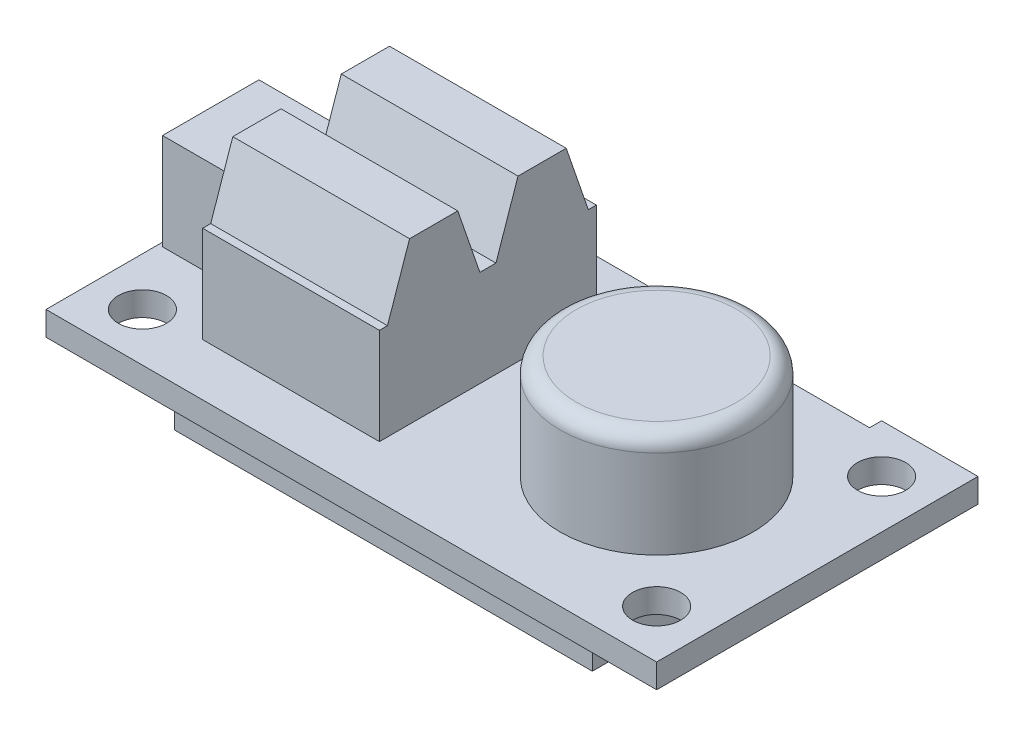
ISO-10303-21;
HEADER;
FILE_DESCRIPTION(('STEP AP214'),'2;1');
FILE_NAME('part.step','',(''),(''),'','','');
FILE_SCHEMA(('AUTOMOTIVE_DESIGN { 1 0 10303 214 1 1 1 1 }'));
ENDSEC;
DATA;
#1=APPLICATION_CONTEXT('core data for automotive mechanical design processes');
#2=APPLICATION_PROTOCOL_DEFINITION('international standard','automotive_design',2000,#1);
#3=PRODUCT_CONTEXT('',#1,'mechanical');
#4=PRODUCT('Part','Part','',(#3));
#5=PRODUCT_RELATED_PRODUCT_CATEGORY('part','',(#4));
#6=PRODUCT_DEFINITION_FORMATION('','',#4);
#7=PRODUCT_DEFINITION_CONTEXT('part definition',#1,'design');
#8=PRODUCT_DEFINITION('design','',#6,#7);
#9=PRODUCT_DEFINITION_SHAPE('','',#8);
#10=(LENGTH_UNIT() NAMED_UNIT(*) SI_UNIT(.MILLI.,.METRE.));
#11=(NAMED_UNIT(*) PLANE_ANGLE_UNIT() SI_UNIT($,.RADIAN.));
#12=(NAMED_UNIT(*) SI_UNIT($,.STERADIAN.) SOLID_ANGLE_UNIT());
#13=UNCERTAINTY_MEASURE_WITH_UNIT(LENGTH_MEASURE(1.E-05),#10,'distance_accuracy_value','');
#14=(GEOMETRIC_REPRESENTATION_CONTEXT(3) GLOBAL_UNCERTAINTY_ASSIGNED_CONTEXT((#13)) GLOBAL_UNIT_ASSIGNED_CONTEXT((#10,
#11,#12)) REPRESENTATION_CONTEXT('',''));
#15=CARTESIAN_POINT('',(0.,0.,0.));
#16=DIRECTION('',(0.,0.,1.));
#17=DIRECTION('',(1.,0.,0.));
#18=AXIS2_PLACEMENT_3D('',#15,#16,#17);
#19=CARTESIAN_POINT('',(0.,0.,0.));
#20=DIRECTION('',(0.,1.,0.));
#21=DIRECTION('',(0.,0.,1.));
#22=AXIS2_PLACEMENT_3D('',#19,#20,#21);
#23=PLANE('',#22);
#24=CARTESIAN_POINT('',(16.,0.,-7.00000000000001));
#25=DIRECTION('',(0.,1.,0.));
#26=DIRECTION('',(0.,0.,1.));
#27=AXIS2_PLACEMENT_3D('',#24,#25,#26);
#28=CIRCLE('',#27,1.5);
#29=CARTESIAN_POINT('',(16.,0.,-5.50000000000001));
#30=VERTEX_POINT('',#29);
#31=EDGE_CURVE('E361',#30,#30,#28,.T.);
#32=ORIENTED_EDGE('',*,*,#31,.T.);
#33=EDGE_LOOP('',(#32));
#34=FACE_BOUND('',#33,.T.);
#35=CARTESIAN_POINT('',(16.,0.,7.00000000000001));
#36=DIRECTION('',(0.,1.,0.));
#37=DIRECTION('',(0.,0.,1.));
#38=AXIS2_PLACEMENT_3D('',#35,#36,#37);
#39=CIRCLE('',#38,1.5);
#40=CARTESIAN_POINT('',(16.,0.,8.50000000000001));
#41=VERTEX_POINT('',#40);
#42=EDGE_CURVE('E369',#41,#41,#39,.T.);
#43=ORIENTED_EDGE('',*,*,#42,.T.);
#44=EDGE_LOOP('',(#43));
#45=FACE_BOUND('',#44,.T.);
#46=CARTESIAN_POINT('',(-16.,0.,7.00000000000001));
#47=DIRECTION('',(0.,1.,0.));
#48=DIRECTION('',(0.,0.,1.));
#49=AXIS2_PLACEMENT_3D('',#46,#47,#48);
#50=CIRCLE('',#49,1.5);
#51=CARTESIAN_POINT('',(-16.,0.,8.50000000000001));
#52=VERTEX_POINT('',#51);
#53=EDGE_CURVE('E375',#52,#52,#50,.T.);
#54=ORIENTED_EDGE('',*,*,#53,.T.);
#55=EDGE_LOOP('',(#54));
#56=FACE_BOUND('',#55,.T.);
#57=CARTESIAN_POINT('',(-16.,0.,-7.00000000000001));
#58=DIRECTION('',(0.,1.,0.));
#59=DIRECTION('',(0.,0.,1.));
#60=AXIS2_PLACEMENT_3D('',#57,#58,#59);
#61=CIRCLE('',#60,1.5);
#62=CARTESIAN_POINT('',(-16.,0.,-5.50000000000001));
#63=VERTEX_POINT('',#62);
#64=EDGE_CURVE('E381',#63,#63,#61,.T.);
#65=ORIENTED_EDGE('',*,*,#64,.T.);
#66=EDGE_LOOP('',(#65));
#67=FACE_BOUND('',#66,.T.);
#68=DIRECTION('',(-1.,0.,0.));
#69=VECTOR('',#68,1.);
#70=CARTESIAN_POINT('',(13.,0.,-10.));
#71=LINE('',#70,#69);
#72=CARTESIAN_POINT('',(19.,0.,-10.));
#73=VERTEX_POINT('',#72);
#74=CARTESIAN_POINT('',(13.,0.,-10.));
#75=VERTEX_POINT('',#74);
#76=EDGE_CURVE('E387',#73,#75,#71,.T.);
#77=ORIENTED_EDGE('',*,*,#76,.F.);
#78=DIRECTION('',(0.,0.,-1.));
#79=VECTOR('',#78,1.);
#80=CARTESIAN_POINT('',(19.,0.,10.));
#81=LINE('',#80,#79);
#82=CARTESIAN_POINT('',(19.,0.,10.));
#83=VERTEX_POINT('',#82);
#84=EDGE_CURVE('E394',#83,#73,#81,.T.);
#85=ORIENTED_EDGE('',*,*,#84,.F.);
#86=DIRECTION('',(1.,0.,0.));
#87=VECTOR('',#86,1.);
#88=CARTESIAN_POINT('',(-19.,0.,10.));
#89=LINE('',#88,#87);
#90=CARTESIAN_POINT('',(-19.,0.,10.));
#91=VERTEX_POINT('',#90);
#92=EDGE_CURVE('E421',#91,#83,#89,.T.);
#93=ORIENTED_EDGE('',*,*,#92,.F.);
#94=DIRECTION('',(0.,0.,1.));
#95=VECTOR('',#94,1.);
#96=CARTESIAN_POINT('',(-19.,0.,10.));
#97=LINE('',#96,#95);
#98=CARTESIAN_POINT('',(-19.,0.,-10.));
#99=VERTEX_POINT('',#98);
#100=EDGE_CURVE('E419',#99,#91,#97,.T.);
#101=ORIENTED_EDGE('',*,*,#100,.F.);
#102=DIRECTION('',(-1.,0.,0.));
#103=VECTOR('',#102,1.);
#104=CARTESIAN_POINT('',(-19.,0.,-10.));
#105=LINE('',#104,#103);
#106=CARTESIAN_POINT('',(0.999999999999999,0.,-10.));
#107=VERTEX_POINT('',#106);
#108=EDGE_CURVE('E417',#107,#99,#105,.T.);
#109=ORIENTED_EDGE('',*,*,#108,.F.);
#110=DIRECTION('',(0.,0.,-1.));
#111=VECTOR('',#110,1.);
#112=CARTESIAN_POINT('',(0.999999999999999,0.,-9.25));
#113=LINE('',#112,#111);
#114=CARTESIAN_POINT('',(0.999999999999999,0.,-9.25));
#115=VERTEX_POINT('',#114);
#116=EDGE_CURVE('E415',#115,#107,#113,.T.);
#117=ORIENTED_EDGE('',*,*,#116,.F.);
#118=DIRECTION('',(-1.,0.,0.));
#119=VECTOR('',#118,1.);
#120=CARTESIAN_POINT('',(13.,0.,-9.25));
#121=LINE('',#120,#119);
#122=CARTESIAN_POINT('',(13.,0.,-9.25));
#123=VERTEX_POINT('',#122);
#124=EDGE_CURVE('E413',#123,#115,#121,.T.);
#125=ORIENTED_EDGE('',*,*,#124,.F.);
#126=DIRECTION('',(0.,0.,1.));
#127=VECTOR('',#126,1.);
#128=CARTESIAN_POINT('',(13.,0.,-10.));
#129=LINE('',#128,#127);
#130=EDGE_CURVE('E411',#75,#123,#129,.T.);
#131=ORIENTED_EDGE('',*,*,#130,.F.);
#132=EDGE_LOOP('',(#77,#85,#93,#101,#109,#117,#125,#131));
#133=FACE_BOUND('',#132,.T.);
#134=DIRECTION('',(0.,0.,1.));
#135=VECTOR('',#134,1.);
#136=CARTESIAN_POINT('',(13.,0.,-8.));
#137=LINE('',#136,#135);
#138=CARTESIAN_POINT('',(13.,0.,-8.));
#139=VERTEX_POINT('',#138);
#140=CARTESIAN_POINT('',(13.,0.,8.));
#141=VERTEX_POINT('',#140);
#142=EDGE_CURVE('E241',#139,#141,#137,.T.);
#143=ORIENTED_EDGE('',*,*,#142,.F.);
#144=DIRECTION('',(1.,0.,0.));
#145=VECTOR('',#144,1.);
#146=CARTESIAN_POINT('',(-13.,0.,-8.));
#147=LINE('',#146,#145);
#148=CARTESIAN_POINT('',(-13.,0.,-8.));
#149=VERTEX_POINT('',#148);
#150=EDGE_CURVE('E238',#149,#139,#147,.T.);
#151=ORIENTED_EDGE('',*,*,#150,.F.);
#152=DIRECTION('',(0.,0.,-1.));
#153=VECTOR('',#152,1.);
#154=CARTESIAN_POINT('',(-13.,0.,-8.));
#155=LINE('',#154,#153);
#156=CARTESIAN_POINT('',(-13.,0.,8.));
#157=VERTEX_POINT('',#156);
#158=EDGE_CURVE('E56',#157,#149,#155,.T.);
#159=ORIENTED_EDGE('',*,*,#158,.F.);
#160=DIRECTION('',(-1.,0.,0.));
#161=VECTOR('',#160,1.);
#162=CARTESIAN_POINT('',(-13.,0.,8.));
#163=LINE('',#162,#161);
#164=EDGE_CURVE('E51',#141,#157,#163,.T.);
#165=ORIENTED_EDGE('',*,*,#164,.F.);
#166=EDGE_LOOP('',(#143,#151,#159,#165));
#167=FACE_BOUND('',#166,.T.);
#168=ADVANCED_FACE('F36',(#34,#45,#56,#67,#133,#167),#23,.F.);
#169=CARTESIAN_POINT('',(0.,1.5,0.));
#170=DIRECTION('',(0.,1.,0.));
#171=DIRECTION('',(0.,0.,1.));
#172=AXIS2_PLACEMENT_3D('',#169,#170,#171);
#173=PLANE('',#172);
#174=DIRECTION('',(0.,0.,-1.));
#175=VECTOR('',#174,1.);
#176=CARTESIAN_POINT('',(-1.5,1.5,6.75));
#177=LINE('',#176,#175);
#178=CARTESIAN_POINT('',(-1.5,1.5,6.75));
#179=VERTEX_POINT('',#178);
#180=CARTESIAN_POINT('',(-1.5,1.5,-6.75));
#181=VERTEX_POINT('',#180);
#182=EDGE_CURVE('E251',#179,#181,#177,.T.);
#183=ORIENTED_EDGE('',*,*,#182,.F.);
#184=DIRECTION('',(-1.,0.,0.));
#185=VECTOR('',#184,1.);
#186=CARTESIAN_POINT('',(-1.5,1.5,6.75));
#187=LINE('',#186,#185);
#188=CARTESIAN_POINT('',(-12.5,1.5,6.75));
#189=VERTEX_POINT('',#188);
#190=EDGE_CURVE('E276',#179,#189,#187,.T.);
#191=ORIENTED_EDGE('',*,*,#190,.T.);
#192=DIRECTION('',(0.,0.,-1.));
#193=VECTOR('',#192,1.);
#194=CARTESIAN_POINT('',(-12.5,1.5,6.75));
#195=LINE('',#194,#193);
#196=CARTESIAN_POINT('',(-12.5,1.5,-6.75));
#197=VERTEX_POINT('',#196);
#198=EDGE_CURVE('E242',#189,#197,#195,.T.);
#199=ORIENTED_EDGE('',*,*,#198,.T.);
#200=DIRECTION('',(-1.,0.,0.));
#201=VECTOR('',#200,1.);
#202=CARTESIAN_POINT('',(-1.5,1.5,-6.75));
#203=LINE('',#202,#201);
#204=EDGE_CURVE('E330',#181,#197,#203,.T.);
#205=ORIENTED_EDGE('',*,*,#204,.F.);
#206=EDGE_LOOP('',(#183,#191,#199,#205));
#207=FACE_BOUND('',#206,.T.);
#208=CARTESIAN_POINT('',(9.,1.5,0.));
#209=DIRECTION('',(0.,1.,0.));
#210=DIRECTION('',(0.,0.,1.));
#211=AXIS2_PLACEMENT_3D('',#208,#209,#210);
#212=CIRCLE('',#211,6.);
#213=CARTESIAN_POINT('',(9.,1.5,6.));
#214=VERTEX_POINT('',#213);
#215=EDGE_CURVE('E362',#214,#214,#212,.T.);
#216=ORIENTED_EDGE('',*,*,#215,.F.);
#217=EDGE_LOOP('',(#216));
#218=FACE_BOUND('',#217,.T.);
#219=CARTESIAN_POINT('',(16.,1.5,7.00000000000001));
#220=DIRECTION('',(0.,1.,0.));
#221=DIRECTION('',(0.,0.,1.));
#222=AXIS2_PLACEMENT_3D('',#219,#220,#221);
#223=CIRCLE('',#222,1.5);
#224=CARTESIAN_POINT('',(16.,1.5,8.50000000000001));
#225=VERTEX_POINT('',#224);
#226=EDGE_CURVE('E372',#225,#225,#223,.T.);
#227=ORIENTED_EDGE('',*,*,#226,.F.);
#228=EDGE_LOOP('',(#227));
#229=FACE_BOUND('',#228,.T.);
#230=CARTESIAN_POINT('',(-16.,1.5,-7.00000000000001));
#231=DIRECTION('',(0.,1.,0.));
#232=DIRECTION('',(0.,0.,1.));
#233=AXIS2_PLACEMENT_3D('',#230,#231,#232);
#234=CIRCLE('',#233,1.5);
#235=CARTESIAN_POINT('',(-16.,1.5,-5.50000000000001));
#236=VERTEX_POINT('',#235);
#237=EDGE_CURVE('E384',#236,#236,#234,.T.);
#238=ORIENTED_EDGE('',*,*,#237,.F.);
#239=EDGE_LOOP('',(#238));
#240=FACE_BOUND('',#239,.T.);
#241=DIRECTION('',(-1.,0.,0.));
#242=VECTOR('',#241,1.);
#243=CARTESIAN_POINT('',(13.,1.5,-10.));
#244=LINE('',#243,#242);
#245=CARTESIAN_POINT('',(19.,1.5,-10.));
#246=VERTEX_POINT('',#245);
#247=CARTESIAN_POINT('',(13.,1.5,-10.));
#248=VERTEX_POINT('',#247);
#249=EDGE_CURVE('E390',#246,#248,#244,.T.);
#250=ORIENTED_EDGE('',*,*,#249,.T.);
#251=DIRECTION('',(0.,0.,1.));
#252=VECTOR('',#251,1.);
#253=CARTESIAN_POINT('',(13.,1.5,-10.));
#254=LINE('',#253,#252);
#255=CARTESIAN_POINT('',(13.,1.5,-9.25));
#256=VERTEX_POINT('',#255);
#257=EDGE_CURVE('E393',#248,#256,#254,.T.);
#258=ORIENTED_EDGE('',*,*,#257,.T.);
#259=DIRECTION('',(-1.,0.,0.));
#260=VECTOR('',#259,1.);
#261=CARTESIAN_POINT('',(13.,1.5,-9.25));
#262=LINE('',#261,#260);
#263=CARTESIAN_POINT('',(0.999999999999999,1.5,-9.25));
#264=VERTEX_POINT('',#263);
#265=EDGE_CURVE('E396',#256,#264,#262,.T.);
#266=ORIENTED_EDGE('',*,*,#265,.T.);
#267=DIRECTION('',(0.,0.,-1.));
#268=VECTOR('',#267,1.);
#269=CARTESIAN_POINT('',(0.999999999999999,1.5,-9.25));
#270=LINE('',#269,#268);
#271=CARTESIAN_POINT('',(0.999999999999999,1.5,-10.));
#272=VERTEX_POINT('',#271);
#273=EDGE_CURVE('E398',#264,#272,#270,.T.);
#274=ORIENTED_EDGE('',*,*,#273,.T.);
#275=DIRECTION('',(-1.,0.,0.));
#276=VECTOR('',#275,1.);
#277=CARTESIAN_POINT('',(-19.,1.5,-10.));
#278=LINE('',#277,#276);
#279=CARTESIAN_POINT('',(-19.,1.5,-10.));
#280=VERTEX_POINT('',#279);
#281=EDGE_CURVE('E400',#272,#280,#278,.T.);
#282=ORIENTED_EDGE('',*,*,#281,.T.);
#283=DIRECTION('',(0.,0.,1.));
#284=VECTOR('',#283,1.);
#285=CARTESIAN_POINT('',(-19.,1.5,10.));
#286=LINE('',#285,#284);
#287=CARTESIAN_POINT('',(-19.,1.5,10.));
#288=VERTEX_POINT('',#287);
#289=EDGE_CURVE('E402',#280,#288,#286,.T.);
#290=ORIENTED_EDGE('',*,*,#289,.T.);
#291=DIRECTION('',(1.,0.,0.));
#292=VECTOR('',#291,1.);
#293=CARTESIAN_POINT('',(-19.,1.5,10.));
#294=LINE('',#293,#292);
#295=CARTESIAN_POINT('',(19.,1.5,10.));
#296=VERTEX_POINT('',#295);
#297=EDGE_CURVE('E404',#288,#296,#294,.T.);
#298=ORIENTED_EDGE('',*,*,#297,.T.);
#299=DIRECTION('',(0.,0.,-1.));
#300=VECTOR('',#299,1.);
#301=CARTESIAN_POINT('',(19.,1.5,10.));
#302=LINE('',#301,#300);
#303=EDGE_CURVE('E406',#296,#246,#302,.T.);
#304=ORIENTED_EDGE('',*,*,#303,.T.);
#305=EDGE_LOOP('',(#250,#258,#266,#274,#282,#290,#298,#304));
#306=FACE_BOUND('',#305,.T.);
#307=CARTESIAN_POINT('',(-16.,1.5,7.00000000000001));
#308=DIRECTION('',(0.,1.,0.));
#309=DIRECTION('',(0.,0.,1.));
#310=AXIS2_PLACEMENT_3D('',#307,#308,#309);
#311=CIRCLE('',#310,1.5);
#312=CARTESIAN_POINT('',(-16.,1.5,8.50000000000001));
#313=VERTEX_POINT('',#312);
#314=EDGE_CURVE('E378',#313,#313,#311,.T.);
#315=ORIENTED_EDGE('',*,*,#314,.F.);
#316=EDGE_LOOP('',(#315));
#317=FACE_BOUND('',#316,.T.);
#318=CARTESIAN_POINT('',(16.,1.5,-7.00000000000001));
#319=DIRECTION('',(0.,1.,0.));
#320=DIRECTION('',(0.,0.,1.));
#321=AXIS2_PLACEMENT_3D('',#318,#319,#320);
#322=CIRCLE('',#321,1.5);
#323=CARTESIAN_POINT('',(16.,1.5,-5.50000000000001));
#324=VERTEX_POINT('',#323);
#325=EDGE_CURVE('E366',#324,#324,#322,.T.);
#326=ORIENTED_EDGE('',*,*,#325,.F.);
#327=EDGE_LOOP('',(#326));
#328=FACE_BOUND('',#327,.T.);
#329=DIRECTION('',(-1.,0.,0.));
#330=VECTOR('',#329,1.);
#331=CARTESIAN_POINT('',(-18.75,1.5,-3.));
#332=LINE('',#331,#330);
#333=CARTESIAN_POINT('',(-13.75,1.5,-3.));
#334=VERTEX_POINT('',#333);
#335=CARTESIAN_POINT('',(-18.75,1.5,-3.));
#336=VERTEX_POINT('',#335);
#337=EDGE_CURVE('E346',#334,#336,#332,.T.);
#338=ORIENTED_EDGE('',*,*,#337,.F.);
#339=DIRECTION('',(0.,0.,-1.));
#340=VECTOR('',#339,1.);
#341=CARTESIAN_POINT('',(-13.75,1.5,-3.));
#342=LINE('',#341,#340);
#343=CARTESIAN_POINT('',(-13.75,1.5,3.));
#344=VERTEX_POINT('',#343);
#345=EDGE_CURVE('E332',#344,#334,#342,.T.);
#346=ORIENTED_EDGE('',*,*,#345,.F.);
#347=DIRECTION('',(1.,0.,0.));
#348=VECTOR('',#347,1.);
#349=CARTESIAN_POINT('',(-18.75,1.5,3.));
#350=LINE('',#349,#348);
#351=CARTESIAN_POINT('',(-18.75,1.5,3.));
#352=VERTEX_POINT('',#351);
#353=EDGE_CURVE('E337',#352,#344,#350,.T.);
#354=ORIENTED_EDGE('',*,*,#353,.F.);
#355=DIRECTION('',(0.,0.,1.));
#356=VECTOR('',#355,1.);
#357=CARTESIAN_POINT('',(-18.75,1.5,-3.));
#358=LINE('',#357,#356);
#359=EDGE_CURVE('E348',#336,#352,#358,.T.);
#360=ORIENTED_EDGE('',*,*,#359,.F.);
#361=EDGE_LOOP('',(#338,#346,#354,#360));
#362=FACE_BOUND('',#361,.T.);
#363=ADVANCED_FACE('F464',(#207,#218,#229,#240,#306,#317,#328,#362),#173,.T.);
#364=CARTESIAN_POINT('',(13.,1.5,-10.));
#365=DIRECTION('',(0.,0.,1.));
#366=DIRECTION('',(1.,0.,0.));
#367=AXIS2_PLACEMENT_3D('',#364,#365,#366);
#368=PLANE('',#367);
#369=ORIENTED_EDGE('',*,*,#76,.T.);
#370=DIRECTION('',(0.,-1.,0.));
#371=VECTOR('',#370,1.);
#372=CARTESIAN_POINT('',(13.,1.5,-10.));
#373=LINE('',#372,#371);
#374=EDGE_CURVE('E365',#248,#75,#373,.T.);
#375=ORIENTED_EDGE('',*,*,#374,.F.);
#376=ORIENTED_EDGE('',*,*,#249,.F.);
#377=DIRECTION('',(0.,-1.,0.));
#378=VECTOR('',#377,1.);
#379=CARTESIAN_POINT('',(19.,1.5,-10.));
#380=LINE('',#379,#378);
#381=EDGE_CURVE('E408',#246,#73,#380,.T.);
#382=ORIENTED_EDGE('',*,*,#381,.T.);
#383=EDGE_LOOP('',(#369,#375,#376,#382));
#384=FACE_BOUND('',#383,.T.);
#385=ADVANCED_FACE('F470',(#384),#368,.F.);
#386=CARTESIAN_POINT('',(13.,1.5,-10.));
#387=DIRECTION('',(1.,0.,0.));
#388=DIRECTION('',(0.,0.,-1.));
#389=AXIS2_PLACEMENT_3D('',#386,#387,#388);
#390=PLANE('',#389);
#391=ORIENTED_EDGE('',*,*,#130,.T.);
#392=DIRECTION('',(0.,-1.,0.));
#393=VECTOR('',#392,1.);
#394=CARTESIAN_POINT('',(13.,1.5,-9.25));
#395=LINE('',#394,#393);
#396=EDGE_CURVE('E441',#256,#123,#395,.T.);
#397=ORIENTED_EDGE('',*,*,#396,.F.);
#398=ORIENTED_EDGE('',*,*,#257,.F.);
#399=ORIENTED_EDGE('',*,*,#374,.T.);
#400=EDGE_LOOP('',(#391,#397,#398,#399));
#401=FACE_BOUND('',#400,.T.);
#402=ADVANCED_FACE('F500',(#401),#390,.F.);
#403=CARTESIAN_POINT('',(13.,1.5,-9.25));
#404=DIRECTION('',(0.,0.,1.));
#405=DIRECTION('',(1.,0.,0.));
#406=AXIS2_PLACEMENT_3D('',#403,#404,#405);
#407=PLANE('',#406);
#408=ORIENTED_EDGE('',*,*,#124,.T.);
#409=DIRECTION('',(0.,-1.,0.));
#410=VECTOR('',#409,1.);
#411=CARTESIAN_POINT('',(0.999999999999999,1.5,-9.25));
#412=LINE('',#411,#410);
#413=EDGE_CURVE('E438',#264,#115,#412,.T.);
#414=ORIENTED_EDGE('',*,*,#413,.F.);
#415=ORIENTED_EDGE('',*,*,#265,.F.);
#416=ORIENTED_EDGE('',*,*,#396,.T.);
#417=EDGE_LOOP('',(#408,#414,#415,#416));
#418=FACE_BOUND('',#417,.T.);
#419=ADVANCED_FACE('F496',(#418),#407,.F.);
#420=CARTESIAN_POINT('',(0.999999999999999,1.5,-9.25));
#421=DIRECTION('',(-1.,0.,0.));
#422=DIRECTION('',(0.,0.,1.));
#423=AXIS2_PLACEMENT_3D('',#420,#421,#422);
#424=PLANE('',#423);
#425=ORIENTED_EDGE('',*,*,#116,.T.);
#426=DIRECTION('',(0.,-1.,0.));
#427=VECTOR('',#426,1.);
#428=CARTESIAN_POINT('',(0.999999999999999,1.5,-10.));
#429=LINE('',#428,#427);
#430=EDGE_CURVE('E435',#272,#107,#429,.T.);
#431=ORIENTED_EDGE('',*,*,#430,.F.);
#432=ORIENTED_EDGE('',*,*,#273,.F.);
#433=ORIENTED_EDGE('',*,*,#413,.T.);
#434=EDGE_LOOP('',(#425,#431,#432,#433));
#435=FACE_BOUND('',#434,.T.);
#436=ADVANCED_FACE('F492',(#435),#424,.F.);
#437=CARTESIAN_POINT('',(-19.,1.5,-10.));
#438=DIRECTION('',(0.,0.,1.));
#439=DIRECTION('',(1.,0.,0.));
#440=AXIS2_PLACEMENT_3D('',#437,#438,#439);
#441=PLANE('',#440);
#442=ORIENTED_EDGE('',*,*,#108,.T.);
#443=DIRECTION('',(0.,-1.,0.));
#444=VECTOR('',#443,1.);
#445=CARTESIAN_POINT('',(-19.,1.5,-10.));
#446=LINE('',#445,#444);
#447=EDGE_CURVE('E432',#280,#99,#446,.T.);
#448=ORIENTED_EDGE('',*,*,#447,.F.);
#449=ORIENTED_EDGE('',*,*,#281,.F.);
#450=ORIENTED_EDGE('',*,*,#430,.T.);
#451=EDGE_LOOP('',(#442,#448,#449,#450));
#452=FACE_BOUND('',#451,.T.);
#453=ADVANCED_FACE('F488',(#452),#441,.F.);
#454=CARTESIAN_POINT('',(-19.,1.5,10.));
#455=DIRECTION('',(1.,0.,0.));
#456=DIRECTION('',(0.,0.,-1.));
#457=AXIS2_PLACEMENT_3D('',#454,#455,#456);
#458=PLANE('',#457);
#459=ORIENTED_EDGE('',*,*,#100,.T.);
#460=DIRECTION('',(0.,-1.,0.));
#461=VECTOR('',#460,1.);
#462=CARTESIAN_POINT('',(-19.,1.5,10.));
#463=LINE('',#462,#461);
#464=EDGE_CURVE('E429',#288,#91,#463,.T.);
#465=ORIENTED_EDGE('',*,*,#464,.F.);
#466=ORIENTED_EDGE('',*,*,#289,.F.);
#467=ORIENTED_EDGE('',*,*,#447,.T.);
#468=EDGE_LOOP('',(#459,#465,#466,#467));
#469=FACE_BOUND('',#468,.T.);
#470=ADVANCED_FACE('F484',(#469),#458,.F.);
#471=CARTESIAN_POINT('',(-19.,1.5,10.));
#472=DIRECTION('',(0.,0.,-1.));
#473=DIRECTION('',(-1.,0.,0.));
#474=AXIS2_PLACEMENT_3D('',#471,#472,#473);
#475=PLANE('',#474);
#476=ORIENTED_EDGE('',*,*,#92,.T.);
#477=DIRECTION('',(0.,-1.,0.));
#478=VECTOR('',#477,1.);
#479=CARTESIAN_POINT('',(19.,1.5,10.));
#480=LINE('',#479,#478);
#481=EDGE_CURVE('E426',#296,#83,#480,.T.);
#482=ORIENTED_EDGE('',*,*,#481,.F.);
#483=ORIENTED_EDGE('',*,*,#297,.F.);
#484=ORIENTED_EDGE('',*,*,#464,.T.);
#485=EDGE_LOOP('',(#476,#482,#483,#484));
#486=FACE_BOUND('',#485,.T.);
#487=ADVANCED_FACE('F480',(#486),#475,.F.);
#488=CARTESIAN_POINT('',(19.,1.5,10.));
#489=DIRECTION('',(-1.,0.,0.));
#490=DIRECTION('',(0.,0.,1.));
#491=AXIS2_PLACEMENT_3D('',#488,#489,#490);
#492=PLANE('',#491);
#493=ORIENTED_EDGE('',*,*,#84,.T.);
#494=ORIENTED_EDGE('',*,*,#381,.F.);
#495=ORIENTED_EDGE('',*,*,#303,.F.);
#496=ORIENTED_EDGE('',*,*,#481,.T.);
#497=EDGE_LOOP('',(#493,#494,#495,#496));
#498=FACE_BOUND('',#497,.T.);
#499=ADVANCED_FACE('F476',(#498),#492,.F.);
#500=CARTESIAN_POINT('',(-16.,1.5,-7.00000000000001));
#501=DIRECTION('',(0.,-1.,0.));
#502=DIRECTION('',(0.,0.,-1.));
#503=AXIS2_PLACEMENT_3D('',#500,#501,#502);
#504=CYLINDRICAL_SURFACE('',#503,1.5);
#505=ORIENTED_EDGE('',*,*,#237,.T.);
#506=EDGE_LOOP('',(#505));
#507=FACE_BOUND('',#506,.T.);
#508=ORIENTED_EDGE('',*,*,#64,.F.);
#509=EDGE_LOOP('',(#508));
#510=FACE_BOUND('',#509,.T.);
#511=ADVANCED_FACE('F479',(#507,#510),#504,.F.);
#512=CARTESIAN_POINT('',(-16.,1.5,7.00000000000001));
#513=DIRECTION('',(0.,-1.,0.));
#514=DIRECTION('',(0.,0.,-1.));
#515=AXIS2_PLACEMENT_3D('',#512,#513,#514);
#516=CYLINDRICAL_SURFACE('',#515,1.5);
#517=ORIENTED_EDGE('',*,*,#314,.T.);
#518=EDGE_LOOP('',(#517));
#519=FACE_BOUND('',#518,.T.);
#520=ORIENTED_EDGE('',*,*,#53,.F.);
#521=EDGE_LOOP('',(#520));
#522=FACE_BOUND('',#521,.T.);
#523=ADVANCED_FACE('F578',(#519,#522),#516,.F.);
#524=CARTESIAN_POINT('',(16.,1.5,7.00000000000001));
#525=DIRECTION('',(0.,-1.,0.));
#526=DIRECTION('',(0.,0.,-1.));
#527=AXIS2_PLACEMENT_3D('',#524,#525,#526);
#528=CYLINDRICAL_SURFACE('',#527,1.5);
#529=ORIENTED_EDGE('',*,*,#226,.T.);
#530=EDGE_LOOP('',(#529));
#531=FACE_BOUND('',#530,.T.);
#532=ORIENTED_EDGE('',*,*,#42,.F.);
#533=EDGE_LOOP('',(#532));
#534=FACE_BOUND('',#533,.T.);
#535=ADVANCED_FACE('F574',(#531,#534),#528,.F.);
#536=CARTESIAN_POINT('',(16.,1.5,-7.00000000000001));
#537=DIRECTION('',(0.,-1.,0.));
#538=DIRECTION('',(0.,0.,-1.));
#539=AXIS2_PLACEMENT_3D('',#536,#537,#538);
#540=CYLINDRICAL_SURFACE('',#539,1.5);
#541=ORIENTED_EDGE('',*,*,#325,.T.);
#542=EDGE_LOOP('',(#541));
#543=FACE_BOUND('',#542,.T.);
#544=ORIENTED_EDGE('',*,*,#31,.F.);
#545=EDGE_LOOP('',(#544));
#546=FACE_BOUND('',#545,.T.);
#547=ADVANCED_FACE('F570',(#543,#546),#540,.F.);
#548=CARTESIAN_POINT('',(9.,8.,0.));
#549=DIRECTION('',(0.,-1.,0.));
#550=DIRECTION('',(0.,0.,-1.));
#551=AXIS2_PLACEMENT_3D('',#548,#549,#550);
#552=CYLINDRICAL_SURFACE('',#551,6.);
#553=CARTESIAN_POINT('',(9.,7.,0.));
#554=DIRECTION('',(0.,1.,0.));
#555=DIRECTION('',(0.,0.,1.));
#556=AXIS2_PLACEMENT_3D('',#553,#554,#555);
#557=CIRCLE('',#556,6.);
#558=CARTESIAN_POINT('',(9.,7.,6.));
#559=VERTEX_POINT('',#558);
#560=EDGE_CURVE('E11',#559,#559,#557,.F.);
#561=ORIENTED_EDGE('',*,*,#560,.T.);
#562=EDGE_LOOP('',(#561));
#563=FACE_BOUND('',#562,.T.);
#564=ORIENTED_EDGE('',*,*,#215,.T.);
#565=EDGE_LOOP('',(#564));
#566=FACE_BOUND('',#565,.T.);
#567=ADVANCED_FACE('F460',(#563,#566),#552,.T.);
#568=CARTESIAN_POINT('',(9.,8.,0.));
#569=DIRECTION('',(0.,1.,0.));
#570=DIRECTION('',(0.,0.,1.));
#571=AXIS2_PLACEMENT_3D('',#568,#569,#570);
#572=PLANE('',#571);
#573=CARTESIAN_POINT('',(9.,8.,0.));
#574=DIRECTION('',(0.,1.,0.));
#575=DIRECTION('',(0.,0.,1.));
#576=AXIS2_PLACEMENT_3D('',#573,#574,#575);
#577=CIRCLE('',#576,5.);
#578=CARTESIAN_POINT('',(9.,8.,5.));
#579=VERTEX_POINT('',#578);
#580=EDGE_CURVE('E44',#579,#579,#577,.T.);
#581=ORIENTED_EDGE('',*,*,#580,.T.);
#582=EDGE_LOOP('',(#581));
#583=FACE_BOUND('',#582,.T.);
#584=ADVANCED_FACE('F448',(#583),#572,.T.);
#585=CARTESIAN_POINT('',(9.,7.,0.));
#586=DIRECTION('',(0.,1.,0.));
#587=DIRECTION('',(0.,0.,1.));
#588=AXIS2_PLACEMENT_3D('',#585,#586,#587);
#589=TOROIDAL_SURFACE('',#588,5.,1.);
#590=ORIENTED_EDGE('',*,*,#560,.F.);
#591=EDGE_LOOP('',(#590));
#592=FACE_BOUND('',#591,.T.);
#593=ORIENTED_EDGE('',*,*,#580,.F.);
#594=EDGE_LOOP('',(#593));
#595=FACE_BOUND('',#594,.T.);
#596=ADVANCED_FACE('F38',(#592,#595),#589,.T.);
#597=CARTESIAN_POINT('',(-13.75,7.5,-3.));
#598=DIRECTION('',(-1.,0.,0.));
#599=DIRECTION('',(0.,0.,1.));
#600=AXIS2_PLACEMENT_3D('',#597,#598,#599);
#601=PLANE('',#600);
#602=ORIENTED_EDGE('',*,*,#345,.T.);
#603=DIRECTION('',(0.,-1.,0.));
#604=VECTOR('',#603,1.);
#605=CARTESIAN_POINT('',(-13.75,7.5,-3.));
#606=LINE('',#605,#604);
#607=CARTESIAN_POINT('',(-13.75,7.5,-3.));
#608=VERTEX_POINT('',#607);
#609=EDGE_CURVE('E359',#608,#334,#606,.T.);
#610=ORIENTED_EDGE('',*,*,#609,.F.);
#611=DIRECTION('',(0.,0.,-1.));
#612=VECTOR('',#611,1.);
#613=CARTESIAN_POINT('',(-13.75,7.5,-3.));
#614=LINE('',#613,#612);
#615=CARTESIAN_POINT('',(-13.75,7.5,3.));
#616=VERTEX_POINT('',#615);
#617=EDGE_CURVE('E333',#616,#608,#614,.T.);
#618=ORIENTED_EDGE('',*,*,#617,.F.);
#619=DIRECTION('',(0.,-1.,0.));
#620=VECTOR('',#619,1.);
#621=CARTESIAN_POINT('',(-13.75,7.5,3.));
#622=LINE('',#621,#620);
#623=EDGE_CURVE('E343',#616,#344,#622,.T.);
#624=ORIENTED_EDGE('',*,*,#623,.T.);
#625=EDGE_LOOP('',(#602,#610,#618,#624));
#626=FACE_BOUND('',#625,.T.);
#627=ADVANCED_FACE('F451',(#626),#601,.F.);
#628=CARTESIAN_POINT('',(-18.75,7.5,-3.));
#629=DIRECTION('',(0.,0.,1.));
#630=DIRECTION('',(1.,0.,0.));
#631=AXIS2_PLACEMENT_3D('',#628,#629,#630);
#632=PLANE('',#631);
#633=ORIENTED_EDGE('',*,*,#337,.T.);
#634=DIRECTION('',(0.,-1.,0.));
#635=VECTOR('',#634,1.);
#636=CARTESIAN_POINT('',(-18.75,7.5,-3.));
#637=LINE('',#636,#635);
#638=CARTESIAN_POINT('',(-18.75,7.5,-3.));
#639=VERTEX_POINT('',#638);
#640=EDGE_CURVE('E356',#639,#336,#637,.T.);
#641=ORIENTED_EDGE('',*,*,#640,.F.);
#642=DIRECTION('',(-1.,0.,0.));
#643=VECTOR('',#642,1.);
#644=CARTESIAN_POINT('',(-18.75,7.5,-3.));
#645=LINE('',#644,#643);
#646=EDGE_CURVE('E336',#608,#639,#645,.T.);
#647=ORIENTED_EDGE('',*,*,#646,.F.);
#648=ORIENTED_EDGE('',*,*,#609,.T.);
#649=EDGE_LOOP('',(#633,#641,#647,#648));
#650=FACE_BOUND('',#649,.T.);
#651=ADVANCED_FACE('F457',(#650),#632,.F.);
#652=CARTESIAN_POINT('',(-18.75,7.5,-3.));
#653=DIRECTION('',(1.,0.,0.));
#654=DIRECTION('',(0.,0.,-1.));
#655=AXIS2_PLACEMENT_3D('',#652,#653,#654);
#656=PLANE('',#655);
#657=ORIENTED_EDGE('',*,*,#359,.T.);
#658=DIRECTION('',(0.,-1.,0.));
#659=VECTOR('',#658,1.);
#660=CARTESIAN_POINT('',(-18.75,7.5,3.));
#661=LINE('',#660,#659);
#662=CARTESIAN_POINT('',(-18.75,7.5,3.));
#663=VERTEX_POINT('',#662);
#664=EDGE_CURVE('E354',#663,#352,#661,.T.);
#665=ORIENTED_EDGE('',*,*,#664,.F.);
#666=DIRECTION('',(0.,0.,1.));
#667=VECTOR('',#666,1.);
#668=CARTESIAN_POINT('',(-18.75,7.5,-3.));
#669=LINE('',#668,#667);
#670=EDGE_CURVE('E339',#639,#663,#669,.T.);
#671=ORIENTED_EDGE('',*,*,#670,.F.);
#672=ORIENTED_EDGE('',*,*,#640,.T.);
#673=EDGE_LOOP('',(#657,#665,#671,#672));
#674=FACE_BOUND('',#673,.T.);
#675=ADVANCED_FACE('F546',(#674),#656,.F.);
#676=CARTESIAN_POINT('',(-18.75,7.5,3.));
#677=DIRECTION('',(0.,0.,-1.));
#678=DIRECTION('',(-1.,0.,0.));
#679=AXIS2_PLACEMENT_3D('',#676,#677,#678);
#680=PLANE('',#679);
#681=ORIENTED_EDGE('',*,*,#353,.T.);
#682=ORIENTED_EDGE('',*,*,#623,.F.);
#683=DIRECTION('',(1.,0.,0.));
#684=VECTOR('',#683,1.);
#685=CARTESIAN_POINT('',(-18.75,7.5,3.));
#686=LINE('',#685,#684);
#687=EDGE_CURVE('E341',#663,#616,#686,.T.);
#688=ORIENTED_EDGE('',*,*,#687,.F.);
#689=ORIENTED_EDGE('',*,*,#664,.T.);
#690=EDGE_LOOP('',(#681,#682,#688,#689));
#691=FACE_BOUND('',#690,.T.);
#692=ADVANCED_FACE('F554',(#691),#680,.F.);
#693=CARTESIAN_POINT('',(0.,7.5,0.));
#694=DIRECTION('',(0.,1.,0.));
#695=DIRECTION('',(0.,0.,1.));
#696=AXIS2_PLACEMENT_3D('',#693,#694,#695);
#697=PLANE('',#696);
#698=ORIENTED_EDGE('',*,*,#617,.T.);
#699=ORIENTED_EDGE('',*,*,#646,.T.);
#700=ORIENTED_EDGE('',*,*,#670,.T.);
#701=ORIENTED_EDGE('',*,*,#687,.T.);
#702=EDGE_LOOP('',(#698,#699,#700,#701));
#703=FACE_BOUND('',#702,.T.);
#704=ADVANCED_FACE('F550',(#703),#697,.T.);
#705=CARTESIAN_POINT('',(-1.5,1.5,-6.75));
#706=DIRECTION('',(0.,0.,1.));
#707=DIRECTION('',(0.,-1.,0.));
#708=AXIS2_PLACEMENT_3D('',#705,#706,#707);
#709=PLANE('',#708);
#710=DIRECTION('',(0.,1.,0.));
#711=VECTOR('',#710,1.);
#712=CARTESIAN_POINT('',(-12.5,1.5,-6.75));
#713=LINE('',#712,#711);
#714=CARTESIAN_POINT('',(-12.5,7.5,-6.75));
#715=VERTEX_POINT('',#714);
#716=EDGE_CURVE('E245',#197,#715,#713,.T.);
#717=ORIENTED_EDGE('',*,*,#716,.T.);
#718=DIRECTION('',(-1.,0.,0.));
#719=VECTOR('',#718,1.);
#720=CARTESIAN_POINT('',(-1.5,7.5,-6.75));
#721=LINE('',#720,#719);
#722=CARTESIAN_POINT('',(-1.5,7.5,-6.75));
#723=VERTEX_POINT('',#722);
#724=EDGE_CURVE('E327',#723,#715,#721,.T.);
#725=ORIENTED_EDGE('',*,*,#724,.F.);
#726=DIRECTION('',(0.,1.,0.));
#727=VECTOR('',#726,1.);
#728=CARTESIAN_POINT('',(-1.5,1.5,-6.75));
#729=LINE('',#728,#727);
#730=EDGE_CURVE('E254',#181,#723,#729,.T.);
#731=ORIENTED_EDGE('',*,*,#730,.F.);
#732=ORIENTED_EDGE('',*,*,#204,.T.);
#733=EDGE_LOOP('',(#717,#725,#731,#732));
#734=FACE_BOUND('',#733,.T.);
#735=ADVANCED_FACE('F561',(#734),#709,.F.);
#736=CARTESIAN_POINT('',(-1.5,7.5,-6.75));
#737=DIRECTION('',(0.,-1.,0.));
#738=DIRECTION('',(0.,0.,-1.));
#739=AXIS2_PLACEMENT_3D('',#736,#737,#738);
#740=PLANE('',#739);
#741=DIRECTION('',(0.,0.,1.));
#742=VECTOR('',#741,1.);
#743=CARTESIAN_POINT('',(-12.5,7.5,-6.75));
#744=LINE('',#743,#742);
#745=CARTESIAN_POINT('',(-12.5,7.5,-6.25));
#746=VERTEX_POINT('',#745);
#747=EDGE_CURVE('E279',#715,#746,#744,.T.);
#748=ORIENTED_EDGE('',*,*,#747,.T.);
#749=DIRECTION('',(-1.,0.,0.));
#750=VECTOR('',#749,1.);
#751=CARTESIAN_POINT('',(-1.5,7.5,-6.25));
#752=LINE('',#751,#750);
#753=CARTESIAN_POINT('',(-1.5,7.5,-6.25));
#754=VERTEX_POINT('',#753);
#755=EDGE_CURVE('E324',#754,#746,#752,.T.);
#756=ORIENTED_EDGE('',*,*,#755,.F.);
#757=DIRECTION('',(0.,0.,1.));
#758=VECTOR('',#757,1.);
#759=CARTESIAN_POINT('',(-1.5,7.5,-6.75));
#760=LINE('',#759,#758);
#761=EDGE_CURVE('E257',#723,#754,#760,.T.);
#762=ORIENTED_EDGE('',*,*,#761,.F.);
#763=ORIENTED_EDGE('',*,*,#724,.T.);
#764=EDGE_LOOP('',(#748,#756,#762,#763));
#765=FACE_BOUND('',#764,.T.);
#766=ADVANCED_FACE('F660',(#765),#740,.F.);
#767=CARTESIAN_POINT('',(-1.5,7.5,-6.25));
#768=DIRECTION('',(0.,-0.325079768511048,0.945686599304867));
#769=DIRECTION('',(0.,-0.945686599304867,-0.325079768511048));
#770=AXIS2_PLACEMENT_3D('',#767,#768,#769);
#771=PLANE('',#770);
#772=DIRECTION('',(0.,0.945686599304867,0.325079768511048));
#773=VECTOR('',#772,1.);
#774=CARTESIAN_POINT('',(-12.5,7.5,-6.25));
#775=LINE('',#774,#773);
#776=CARTESIAN_POINT('',(-12.5,11.5,-4.875));
#777=VERTEX_POINT('',#776);
#778=EDGE_CURVE('E281',#746,#777,#775,.T.);
#779=ORIENTED_EDGE('',*,*,#778,.T.);
#780=DIRECTION('',(-1.,0.,0.));
#781=VECTOR('',#780,1.);
#782=CARTESIAN_POINT('',(-1.5,11.5,-4.875));
#783=LINE('',#782,#781);
#784=CARTESIAN_POINT('',(-1.5,11.5,-4.875));
#785=VERTEX_POINT('',#784);
#786=EDGE_CURVE('E321',#785,#777,#783,.T.);
#787=ORIENTED_EDGE('',*,*,#786,.F.);
#788=DIRECTION('',(0.,0.945686599304867,0.325079768511048));
#789=VECTOR('',#788,1.);
#790=CARTESIAN_POINT('',(-1.5,7.5,-6.25));
#791=LINE('',#790,#789);
#792=EDGE_CURVE('E259',#754,#785,#791,.T.);
#793=ORIENTED_EDGE('',*,*,#792,.F.);
#794=ORIENTED_EDGE('',*,*,#755,.T.);
#795=EDGE_LOOP('',(#779,#787,#793,#794));
#796=FACE_BOUND('',#795,.T.);
#797=ADVANCED_FACE('F669',(#796),#771,.F.);
#798=CARTESIAN_POINT('',(-1.5,11.5,-4.875));
#799=DIRECTION('',(0.,-1.,0.));
#800=DIRECTION('',(0.,0.,-1.));
#801=AXIS2_PLACEMENT_3D('',#798,#799,#800);
#802=PLANE('',#801);
#803=DIRECTION('',(0.,0.,1.));
#804=VECTOR('',#803,1.);
#805=CARTESIAN_POINT('',(-12.5,11.5,-4.875));
#806=LINE('',#805,#804);
#807=CARTESIAN_POINT('',(-12.5,11.5,-1.875));
#808=VERTEX_POINT('',#807);
#809=EDGE_CURVE('E283',#777,#808,#806,.T.);
#810=ORIENTED_EDGE('',*,*,#809,.T.);
#811=DIRECTION('',(-1.,0.,0.));
#812=VECTOR('',#811,1.);
#813=CARTESIAN_POINT('',(-1.5,11.5,-1.875));
#814=LINE('',#813,#812);
#815=CARTESIAN_POINT('',(-1.5,11.5,-1.875));
#816=VERTEX_POINT('',#815);
#817=EDGE_CURVE('E318',#816,#808,#814,.T.);
#818=ORIENTED_EDGE('',*,*,#817,.F.);
#819=DIRECTION('',(0.,0.,1.));
#820=VECTOR('',#819,1.);
#821=CARTESIAN_POINT('',(-1.5,11.5,-4.875));
#822=LINE('',#821,#820);
#823=EDGE_CURVE('E261',#785,#816,#822,.T.);
#824=ORIENTED_EDGE('',*,*,#823,.F.);
#825=ORIENTED_EDGE('',*,*,#786,.T.);
#826=EDGE_LOOP('',(#810,#818,#824,#825));
#827=FACE_BOUND('',#826,.T.);
#828=ADVANCED_FACE('F679',(#827),#802,.F.);
#829=CARTESIAN_POINT('',(-1.5,11.5,-1.875));
#830=DIRECTION('',(0.,-0.325079768511048,-0.945686599304867));
#831=DIRECTION('',(0.,0.945686599304867,-0.325079768511048));
#832=AXIS2_PLACEMENT_3D('',#829,#830,#831);
#833=PLANE('',#832);
#834=DIRECTION('',(0.,-0.945686599304867,0.325079768511048));
#835=VECTOR('',#834,1.);
#836=CARTESIAN_POINT('',(-12.5,11.5,-1.875));
#837=LINE('',#836,#835);
#838=CARTESIAN_POINT('',(-12.5,7.5,-0.5));
#839=VERTEX_POINT('',#838);
#840=EDGE_CURVE('E285',#808,#839,#837,.T.);
#841=ORIENTED_EDGE('',*,*,#840,.T.);
#842=DIRECTION('',(-1.,0.,0.));
#843=VECTOR('',#842,1.);
#844=CARTESIAN_POINT('',(-1.5,7.5,-0.5));
#845=LINE('',#844,#843);
#846=CARTESIAN_POINT('',(-1.5,7.5,-0.5));
#847=VERTEX_POINT('',#846);
#848=EDGE_CURVE('E315',#847,#839,#845,.T.);
#849=ORIENTED_EDGE('',*,*,#848,.F.);
#850=DIRECTION('',(0.,-0.945686599304867,0.325079768511048));
#851=VECTOR('',#850,1.);
#852=CARTESIAN_POINT('',(-1.5,11.5,-1.875));
#853=LINE('',#852,#851);
#854=EDGE_CURVE('E263',#816,#847,#853,.T.);
#855=ORIENTED_EDGE('',*,*,#854,.F.);
#856=ORIENTED_EDGE('',*,*,#817,.T.);
#857=EDGE_LOOP('',(#841,#849,#855,#856));
#858=FACE_BOUND('',#857,.T.);
#859=ADVANCED_FACE('F689',(#858),#833,.F.);
#860=CARTESIAN_POINT('',(-1.5,7.5,-0.5));
#861=DIRECTION('',(0.,-1.,0.));
#862=DIRECTION('',(0.,0.,-1.));
#863=AXIS2_PLACEMENT_3D('',#860,#861,#862);
#864=PLANE('',#863);
#865=DIRECTION('',(0.,0.,1.));
#866=VECTOR('',#865,1.);
#867=CARTESIAN_POINT('',(-12.5,7.5,-0.5));
#868=LINE('',#867,#866);
#869=CARTESIAN_POINT('',(-12.5,7.5,0.5));
#870=VERTEX_POINT('',#869);
#871=EDGE_CURVE('E287',#839,#870,#868,.T.);
#872=ORIENTED_EDGE('',*,*,#871,.T.);
#873=DIRECTION('',(-1.,0.,0.));
#874=VECTOR('',#873,1.);
#875=CARTESIAN_POINT('',(-1.5,7.5,0.5));
#876=LINE('',#875,#874);
#877=CARTESIAN_POINT('',(-1.5,7.5,0.5));
#878=VERTEX_POINT('',#877);
#879=EDGE_CURVE('E312',#878,#870,#876,.T.);
#880=ORIENTED_EDGE('',*,*,#879,.F.);
#881=DIRECTION('',(0.,0.,1.));
#882=VECTOR('',#881,1.);
#883=CARTESIAN_POINT('',(-1.5,7.5,-0.5));
#884=LINE('',#883,#882);
#885=EDGE_CURVE('E265',#847,#878,#884,.T.);
#886=ORIENTED_EDGE('',*,*,#885,.F.);
#887=ORIENTED_EDGE('',*,*,#848,.T.);
#888=EDGE_LOOP('',(#872,#880,#886,#887));
#889=FACE_BOUND('',#888,.T.);
#890=ADVANCED_FACE('F699',(#889),#864,.F.);
#891=CARTESIAN_POINT('',(-1.5,7.5,0.5));
#892=DIRECTION('',(0.,-0.325079768511048,0.945686599304867));
#893=DIRECTION('',(0.,-0.945686599304867,-0.325079768511048));
#894=AXIS2_PLACEMENT_3D('',#891,#892,#893);
#895=PLANE('',#894);
#896=DIRECTION('',(0.,0.945686599304867,0.325079768511048));
#897=VECTOR('',#896,1.);
#898=CARTESIAN_POINT('',(-12.5,7.5,0.5));
#899=LINE('',#898,#897);
#900=CARTESIAN_POINT('',(-12.5,11.5,1.875));
#901=VERTEX_POINT('',#900);
#902=EDGE_CURVE('E289',#870,#901,#899,.T.);
#903=ORIENTED_EDGE('',*,*,#902,.T.);
#904=DIRECTION('',(-1.,0.,0.));
#905=VECTOR('',#904,1.);
#906=CARTESIAN_POINT('',(-1.5,11.5,1.875));
#907=LINE('',#906,#905);
#908=CARTESIAN_POINT('',(-1.5,11.5,1.875));
#909=VERTEX_POINT('',#908);
#910=EDGE_CURVE('E309',#909,#901,#907,.T.);
#911=ORIENTED_EDGE('',*,*,#910,.F.);
#912=DIRECTION('',(0.,0.945686599304867,0.325079768511048));
#913=VECTOR('',#912,1.);
#914=CARTESIAN_POINT('',(-1.5,7.5,0.5));
#915=LINE('',#914,#913);
#916=EDGE_CURVE('E267',#878,#909,#915,.T.);
#917=ORIENTED_EDGE('',*,*,#916,.F.);
#918=ORIENTED_EDGE('',*,*,#879,.T.);
#919=EDGE_LOOP('',(#903,#911,#917,#918));
#920=FACE_BOUND('',#919,.T.);
#921=ADVANCED_FACE('F709',(#920),#895,.F.);
#922=CARTESIAN_POINT('',(-1.5,11.5,1.875));
#923=DIRECTION('',(0.,-1.,0.));
#924=DIRECTION('',(0.,0.,-1.));
#925=AXIS2_PLACEMENT_3D('',#922,#923,#924);
#926=PLANE('',#925);
#927=DIRECTION('',(0.,0.,1.));
#928=VECTOR('',#927,1.);
#929=CARTESIAN_POINT('',(-12.5,11.5,1.875));
#930=LINE('',#929,#928);
#931=CARTESIAN_POINT('',(-12.5,11.5,4.875));
#932=VERTEX_POINT('',#931);
#933=EDGE_CURVE('E291',#901,#932,#930,.T.);
#934=ORIENTED_EDGE('',*,*,#933,.T.);
#935=DIRECTION('',(-1.,0.,0.));
#936=VECTOR('',#935,1.);
#937=CARTESIAN_POINT('',(-1.5,11.5,4.875));
#938=LINE('',#937,#936);
#939=CARTESIAN_POINT('',(-1.5,11.5,4.875));
#940=VERTEX_POINT('',#939);
#941=EDGE_CURVE('E306',#940,#932,#938,.T.);
#942=ORIENTED_EDGE('',*,*,#941,.F.);
#943=DIRECTION('',(0.,0.,1.));
#944=VECTOR('',#943,1.);
#945=CARTESIAN_POINT('',(-1.5,11.5,1.875));
#946=LINE('',#945,#944);
#947=EDGE_CURVE('E269',#909,#940,#946,.T.);
#948=ORIENTED_EDGE('',*,*,#947,.F.);
#949=ORIENTED_EDGE('',*,*,#910,.T.);
#950=EDGE_LOOP('',(#934,#942,#948,#949));
#951=FACE_BOUND('',#950,.T.);
#952=ADVANCED_FACE('F719',(#951),#926,.F.);
#953=CARTESIAN_POINT('',(-1.5,11.5,4.875));
#954=DIRECTION('',(0.,-0.325079768511048,-0.945686599304867));
#955=DIRECTION('',(0.,0.945686599304867,-0.325079768511048));
#956=AXIS2_PLACEMENT_3D('',#953,#954,#955);
#957=PLANE('',#956);
#958=DIRECTION('',(0.,-0.945686599304867,0.325079768511048));
#959=VECTOR('',#958,1.);
#960=CARTESIAN_POINT('',(-12.5,11.5,4.875));
#961=LINE('',#960,#959);
#962=CARTESIAN_POINT('',(-12.5,7.5,6.25));
#963=VERTEX_POINT('',#962);
#964=EDGE_CURVE('E293',#932,#963,#961,.T.);
#965=ORIENTED_EDGE('',*,*,#964,.T.);
#966=DIRECTION('',(-1.,0.,0.));
#967=VECTOR('',#966,1.);
#968=CARTESIAN_POINT('',(-1.5,7.5,6.25));
#969=LINE('',#968,#967);
#970=CARTESIAN_POINT('',(-1.5,7.5,6.25));
#971=VERTEX_POINT('',#970);
#972=EDGE_CURVE('E303',#971,#963,#969,.T.);
#973=ORIENTED_EDGE('',*,*,#972,.F.);
#974=DIRECTION('',(0.,-0.945686599304867,0.325079768511048));
#975=VECTOR('',#974,1.);
#976=CARTESIAN_POINT('',(-1.5,11.5,4.875));
#977=LINE('',#976,#975);
#978=EDGE_CURVE('E271',#940,#971,#977,.T.);
#979=ORIENTED_EDGE('',*,*,#978,.F.);
#980=ORIENTED_EDGE('',*,*,#941,.T.);
#981=EDGE_LOOP('',(#965,#973,#979,#980));
#982=FACE_BOUND('',#981,.T.);
#983=ADVANCED_FACE('F729',(#982),#957,.F.);
#984=CARTESIAN_POINT('',(-1.5,7.5,6.25));
#985=DIRECTION('',(0.,-1.,0.));
#986=DIRECTION('',(0.,0.,-1.));
#987=AXIS2_PLACEMENT_3D('',#984,#985,#986);
#988=PLANE('',#987);
#989=DIRECTION('',(0.,0.,1.));
#990=VECTOR('',#989,1.);
#991=CARTESIAN_POINT('',(-12.5,7.5,6.25));
#992=LINE('',#991,#990);
#993=CARTESIAN_POINT('',(-12.5,7.5,6.75));
#994=VERTEX_POINT('',#993);
#995=EDGE_CURVE('E295',#963,#994,#992,.T.);
#996=ORIENTED_EDGE('',*,*,#995,.T.);
#997=DIRECTION('',(-1.,0.,0.));
#998=VECTOR('',#997,1.);
#999=CARTESIAN_POINT('',(-1.5,7.5,6.75));
#1000=LINE('',#999,#998);
#1001=CARTESIAN_POINT('',(-1.5,7.5,6.75));
#1002=VERTEX_POINT('',#1001);
#1003=EDGE_CURVE('E300',#1002,#994,#1000,.T.);
#1004=ORIENTED_EDGE('',*,*,#1003,.F.);
#1005=DIRECTION('',(0.,0.,1.));
#1006=VECTOR('',#1005,1.);
#1007=CARTESIAN_POINT('',(-1.5,7.5,6.25));
#1008=LINE('',#1007,#1006);
#1009=EDGE_CURVE('E273',#971,#1002,#1008,.T.);
#1010=ORIENTED_EDGE('',*,*,#1009,.F.);
#1011=ORIENTED_EDGE('',*,*,#972,.T.);
#1012=EDGE_LOOP('',(#996,#1004,#1010,#1011));
#1013=FACE_BOUND('',#1012,.T.);
#1014=ADVANCED_FACE('F739',(#1013),#988,.F.);
#1015=CARTESIAN_POINT('',(-1.5,7.5,6.75));
#1016=DIRECTION('',(0.,0.,-1.));
#1017=DIRECTION('',(0.,1.,0.));
#1018=AXIS2_PLACEMENT_3D('',#1015,#1016,#1017);
#1019=PLANE('',#1018);
#1020=DIRECTION('',(0.,-1.,0.));
#1021=VECTOR('',#1020,1.);
#1022=CARTESIAN_POINT('',(-12.5,7.5,6.75));
#1023=LINE('',#1022,#1021);
#1024=EDGE_CURVE('E255',#994,#189,#1023,.T.);
#1025=ORIENTED_EDGE('',*,*,#1024,.T.);
#1026=ORIENTED_EDGE('',*,*,#190,.F.);
#1027=DIRECTION('',(0.,-1.,0.));
#1028=VECTOR('',#1027,1.);
#1029=CARTESIAN_POINT('',(-1.5,7.5,6.75));
#1030=LINE('',#1029,#1028);
#1031=EDGE_CURVE('E275',#1002,#179,#1030,.T.);
#1032=ORIENTED_EDGE('',*,*,#1031,.F.);
#1033=ORIENTED_EDGE('',*,*,#1003,.T.);
#1034=EDGE_LOOP('',(#1025,#1026,#1032,#1033));
#1035=FACE_BOUND('',#1034,.T.);
#1036=ADVANCED_FACE('F749',(#1035),#1019,.F.);
#1037=CARTESIAN_POINT('',(-1.5,0.,0.));
#1038=DIRECTION('',(1.,0.,0.));
#1039=DIRECTION('',(0.,0.,-1.));
#1040=AXIS2_PLACEMENT_3D('',#1037,#1038,#1039);
#1041=PLANE('',#1040);
#1042=ORIENTED_EDGE('',*,*,#182,.T.);
#1043=ORIENTED_EDGE('',*,*,#730,.T.);
#1044=ORIENTED_EDGE('',*,*,#761,.T.);
#1045=ORIENTED_EDGE('',*,*,#792,.T.);
#1046=ORIENTED_EDGE('',*,*,#823,.T.);
#1047=ORIENTED_EDGE('',*,*,#854,.T.);
#1048=ORIENTED_EDGE('',*,*,#885,.T.);
#1049=ORIENTED_EDGE('',*,*,#916,.T.);
#1050=ORIENTED_EDGE('',*,*,#947,.T.);
#1051=ORIENTED_EDGE('',*,*,#978,.T.);
#1052=ORIENTED_EDGE('',*,*,#1009,.T.);
#1053=ORIENTED_EDGE('',*,*,#1031,.T.);
#1054=EDGE_LOOP('',(#1042,#1043,#1044,#1045,#1046,#1047,#1048,#1049,#1050,#1051,#1052,#1053));
#1055=FACE_BOUND('',#1054,.T.);
#1056=ADVANCED_FACE('F759',(#1055),#1041,.T.);
#1057=CARTESIAN_POINT('',(-12.5,0.,0.));
#1058=DIRECTION('',(1.,0.,0.));
#1059=DIRECTION('',(0.,0.,-1.));
#1060=AXIS2_PLACEMENT_3D('',#1057,#1058,#1059);
#1061=PLANE('',#1060);
#1062=ORIENTED_EDGE('',*,*,#198,.F.);
#1063=ORIENTED_EDGE('',*,*,#1024,.F.);
#1064=ORIENTED_EDGE('',*,*,#995,.F.);
#1065=ORIENTED_EDGE('',*,*,#964,.F.);
#1066=ORIENTED_EDGE('',*,*,#933,.F.);
#1067=ORIENTED_EDGE('',*,*,#902,.F.);
#1068=ORIENTED_EDGE('',*,*,#871,.F.);
#1069=ORIENTED_EDGE('',*,*,#840,.F.);
#1070=ORIENTED_EDGE('',*,*,#809,.F.);
#1071=ORIENTED_EDGE('',*,*,#778,.F.);
#1072=ORIENTED_EDGE('',*,*,#747,.F.);
#1073=ORIENTED_EDGE('',*,*,#716,.F.);
#1074=EDGE_LOOP('',(#1062,#1063,#1064,#1065,#1066,#1067,#1068,#1069,#1070,#1071,#1072,#1073));
#1075=FACE_BOUND('',#1074,.T.);
#1076=ADVANCED_FACE('F769',(#1075),#1061,.F.);
#1077=CARTESIAN_POINT('',(13.,-3.,-8.));
#1078=DIRECTION('',(-1.,0.,0.));
#1079=DIRECTION('',(0.,0.,1.));
#1080=AXIS2_PLACEMENT_3D('',#1077,#1078,#1079);
#1081=PLANE('',#1080);
#1082=ORIENTED_EDGE('',*,*,#142,.T.);
#1083=DIRECTION('',(0.,1.,0.));
#1084=VECTOR('',#1083,1.);
#1085=CARTESIAN_POINT('',(13.,-3.,8.));
#1086=LINE('',#1085,#1084);
#1087=CARTESIAN_POINT('',(13.,-3.,8.));
#1088=VERTEX_POINT('',#1087);
#1089=EDGE_CURVE('E222',#1088,#141,#1086,.T.);
#1090=ORIENTED_EDGE('',*,*,#1089,.F.);
#1091=DIRECTION('',(0.,0.,1.));
#1092=VECTOR('',#1091,1.);
#1093=CARTESIAN_POINT('',(13.,-3.,-8.));
#1094=LINE('',#1093,#1092);
#1095=CARTESIAN_POINT('',(13.,-3.,-8.));
#1096=VERTEX_POINT('',#1095);
#1097=EDGE_CURVE('E229',#1096,#1088,#1094,.T.);
#1098=ORIENTED_EDGE('',*,*,#1097,.F.);
#1099=DIRECTION('',(0.,1.,0.));
#1100=VECTOR('',#1099,1.);
#1101=CARTESIAN_POINT('',(13.,-3.,-8.));
#1102=LINE('',#1101,#1100);
#1103=EDGE_CURVE('E833',#1096,#139,#1102,.T.);
#1104=ORIENTED_EDGE('',*,*,#1103,.T.);
#1105=EDGE_LOOP('',(#1082,#1090,#1098,#1104));
#1106=FACE_BOUND('',#1105,.T.);
#1107=ADVANCED_FACE('F240',(#1106),#1081,.F.);
#1108=CARTESIAN_POINT('',(-13.,-3.,8.));
#1109=DIRECTION('',(0.,0.,-1.));
#1110=DIRECTION('',(-1.,0.,0.));
#1111=AXIS2_PLACEMENT_3D('',#1108,#1109,#1110);
#1112=PLANE('',#1111);
#1113=ORIENTED_EDGE('',*,*,#164,.T.);
#1114=DIRECTION('',(0.,1.,0.));
#1115=VECTOR('',#1114,1.);
#1116=CARTESIAN_POINT('',(-13.,-3.,8.));
#1117=LINE('',#1116,#1115);
#1118=CARTESIAN_POINT('',(-13.,-3.,8.));
#1119=VERTEX_POINT('',#1118);
#1120=EDGE_CURVE('E225',#1119,#157,#1117,.T.);
#1121=ORIENTED_EDGE('',*,*,#1120,.F.);
#1122=DIRECTION('',(-1.,0.,0.));
#1123=VECTOR('',#1122,1.);
#1124=CARTESIAN_POINT('',(-13.,-3.,8.));
#1125=LINE('',#1124,#1123);
#1126=EDGE_CURVE('E218',#1088,#1119,#1125,.T.);
#1127=ORIENTED_EDGE('',*,*,#1126,.F.);
#1128=ORIENTED_EDGE('',*,*,#1089,.T.);
#1129=EDGE_LOOP('',(#1113,#1121,#1127,#1128));
#1130=FACE_BOUND('',#1129,.T.);
#1131=ADVANCED_FACE('F220',(#1130),#1112,.F.);
#1132=CARTESIAN_POINT('',(-13.,-3.,-8.));
#1133=DIRECTION('',(1.,0.,0.));
#1134=DIRECTION('',(0.,0.,-1.));
#1135=AXIS2_PLACEMENT_3D('',#1132,#1133,#1134);
#1136=PLANE('',#1135);
#1137=ORIENTED_EDGE('',*,*,#158,.T.);
#1138=DIRECTION('',(0.,1.,0.));
#1139=VECTOR('',#1138,1.);
#1140=CARTESIAN_POINT('',(-13.,-3.,-8.));
#1141=LINE('',#1140,#1139);
#1142=CARTESIAN_POINT('',(-13.,-3.,-8.));
#1143=VERTEX_POINT('',#1142);
#1144=EDGE_CURVE('E247',#1143,#149,#1141,.T.);
#1145=ORIENTED_EDGE('',*,*,#1144,.F.);
#1146=DIRECTION('',(0.,0.,-1.));
#1147=VECTOR('',#1146,1.);
#1148=CARTESIAN_POINT('',(-13.,-3.,-8.));
#1149=LINE('',#1148,#1147);
#1150=EDGE_CURVE('E228',#1119,#1143,#1149,.T.);
#1151=ORIENTED_EDGE('',*,*,#1150,.F.);
#1152=ORIENTED_EDGE('',*,*,#1120,.T.);
#1153=EDGE_LOOP('',(#1137,#1145,#1151,#1152));
#1154=FACE_BOUND('',#1153,.T.);
#1155=ADVANCED_FACE('F800',(#1154),#1136,.F.);
#1156=CARTESIAN_POINT('',(-13.,-3.,-8.));
#1157=DIRECTION('',(0.,0.,1.));
#1158=DIRECTION('',(1.,0.,0.));
#1159=AXIS2_PLACEMENT_3D('',#1156,#1157,#1158);
#1160=PLANE('',#1159);
#1161=ORIENTED_EDGE('',*,*,#150,.T.);
#1162=ORIENTED_EDGE('',*,*,#1103,.F.);
#1163=DIRECTION('',(1.,0.,0.));
#1164=VECTOR('',#1163,1.);
#1165=CARTESIAN_POINT('',(-13.,-3.,-8.));
#1166=LINE('',#1165,#1164);
#1167=EDGE_CURVE('E234',#1143,#1096,#1166,.T.);
#1168=ORIENTED_EDGE('',*,*,#1167,.F.);
#1169=ORIENTED_EDGE('',*,*,#1144,.T.);
#1170=EDGE_LOOP('',(#1161,#1162,#1168,#1169));
#1171=FACE_BOUND('',#1170,.T.);
#1172=ADVANCED_FACE('F809',(#1171),#1160,.F.);
#1173=CARTESIAN_POINT('',(0.,-3.,0.));
#1174=DIRECTION('',(0.,1.,0.));
#1175=DIRECTION('',(0.,0.,1.));
#1176=AXIS2_PLACEMENT_3D('',#1173,#1174,#1175);
#1177=PLANE('',#1176);
#1178=ORIENTED_EDGE('',*,*,#1097,.T.);
#1179=ORIENTED_EDGE('',*,*,#1126,.T.);
#1180=ORIENTED_EDGE('',*,*,#1150,.T.);
#1181=ORIENTED_EDGE('',*,*,#1167,.T.);
#1182=EDGE_LOOP('',(#1178,#1179,#1180,#1181));
#1183=FACE_BOUND('',#1182,.T.);
#1184=ADVANCED_FACE('F232',(#1183),#1177,.F.);
#1185=CLOSED_SHELL('',(#168,#363,#385,#402,#419,#436,#453,#470,#487,#499,#511,#523,#535,#547,
#567,#584,#596,#627,#651,#675,#692,#704,#735,#766,#797,#828,#859,#890,#921,#952,#983,#1014,
#1036,#1056,#1076,#1107,#1131,#1155,#1172,#1184));
#1186=MANIFOLD_SOLID_BREP('B2',#1185);
#1187=ADVANCED_BREP_SHAPE_REPRESENTATION('',(#18,#1186),#14);
#1188=SHAPE_DEFINITION_REPRESENTATION(#9,#1187);
ENDSEC;
END-ISO-10303-21;
